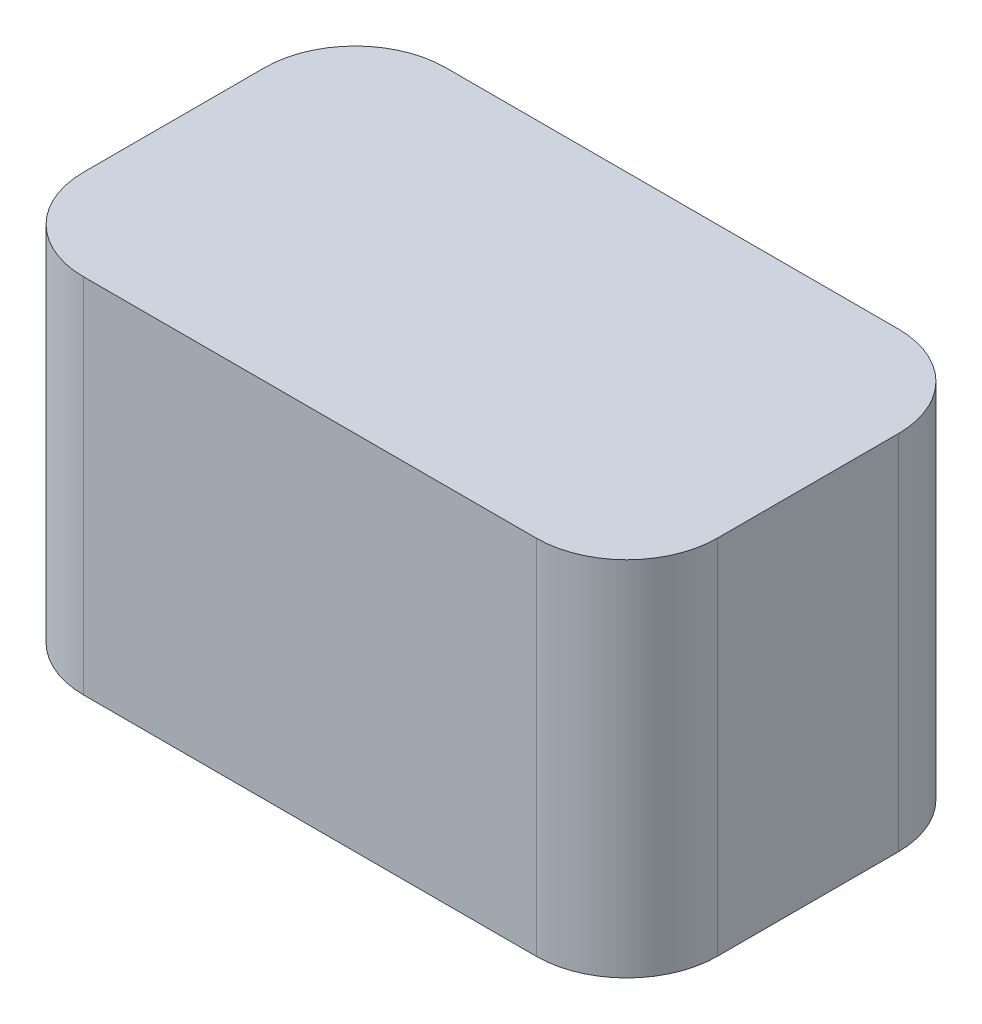
ISO-10303-21;
HEADER;
FILE_DESCRIPTION(('STEP AP214'),'2;1');
FILE_NAME('part.step','',(''),(''),'','','');
FILE_SCHEMA(('AUTOMOTIVE_DESIGN { 1 0 10303 214 1 1 1 1 }'));
ENDSEC;
DATA;
#1=APPLICATION_CONTEXT('core data for automotive mechanical design processes');
#2=APPLICATION_PROTOCOL_DEFINITION('international standard','automotive_design',2000,#1);
#3=PRODUCT_CONTEXT('',#1,'mechanical');
#4=PRODUCT('Part','Part','',(#3));
#5=PRODUCT_RELATED_PRODUCT_CATEGORY('part','',(#4));
#6=PRODUCT_DEFINITION_FORMATION('','',#4);
#7=PRODUCT_DEFINITION_CONTEXT('part definition',#1,'design');
#8=PRODUCT_DEFINITION('design','',#6,#7);
#9=PRODUCT_DEFINITION_SHAPE('','',#8);
#10=(LENGTH_UNIT() NAMED_UNIT(*) SI_UNIT(.MILLI.,.METRE.));
#11=(NAMED_UNIT(*) PLANE_ANGLE_UNIT() SI_UNIT($,.RADIAN.));
#12=(NAMED_UNIT(*) SI_UNIT($,.STERADIAN.) SOLID_ANGLE_UNIT());
#13=UNCERTAINTY_MEASURE_WITH_UNIT(LENGTH_MEASURE(1.E-05),#10,'distance_accuracy_value','');
#14=(GEOMETRIC_REPRESENTATION_CONTEXT(3) GLOBAL_UNCERTAINTY_ASSIGNED_CONTEXT((#13)) GLOBAL_UNIT_ASSIGNED_CONTEXT((#10,
#11,#12)) REPRESENTATION_CONTEXT('',''));
#15=CARTESIAN_POINT('',(0.,0.,0.));
#16=DIRECTION('',(0.,0.,1.));
#17=DIRECTION('',(1.,0.,0.));
#18=AXIS2_PLACEMENT_3D('',#15,#16,#17);
#19=CARTESIAN_POINT('',(-22.225,25.4,-12.7));
#20=DIRECTION('',(1.,0.,0.));
#21=DIRECTION('',(0.,0.,-1.));
#22=AXIS2_PLACEMENT_3D('',#19,#20,#21);
#23=PLANE('',#22);
#24=DIRECTION('',(0.,0.,1.));
#25=VECTOR('',#24,1.);
#26=CARTESIAN_POINT('',(-22.225,25.4,-12.7));
#27=LINE('',#26,#25);
#28=CARTESIAN_POINT('',(-22.225,25.4,-6.35));
#29=VERTEX_POINT('',#28);
#30=CARTESIAN_POINT('',(-22.225,25.4,6.35));
#31=VERTEX_POINT('',#30);
#32=EDGE_CURVE('E139',#29,#31,#27,.T.);
#33=ORIENTED_EDGE('',*,*,#32,.F.);
#34=DIRECTION('',(0.,-1.,0.));
#35=VECTOR('',#34,1.);
#36=CARTESIAN_POINT('',(-22.225,25.4,-6.35));
#37=LINE('',#36,#35);
#38=CARTESIAN_POINT('',(-22.225,0.,-6.35));
#39=VERTEX_POINT('',#38);
#40=EDGE_CURVE('E178',#29,#39,#37,.T.);
#41=ORIENTED_EDGE('',*,*,#40,.T.);
#42=DIRECTION('',(0.,0.,1.));
#43=VECTOR('',#42,1.);
#44=CARTESIAN_POINT('',(-22.225,0.,-12.7));
#45=LINE('',#44,#43);
#46=CARTESIAN_POINT('',(-22.225,0.,6.35));
#47=VERTEX_POINT('',#46);
#48=EDGE_CURVE('E192',#39,#47,#45,.T.);
#49=ORIENTED_EDGE('',*,*,#48,.T.);
#50=DIRECTION('',(0.,-1.,0.));
#51=VECTOR('',#50,1.);
#52=CARTESIAN_POINT('',(-22.225,25.4,6.35));
#53=LINE('',#52,#51);
#54=EDGE_CURVE('E175',#47,#31,#53,.F.);
#55=ORIENTED_EDGE('',*,*,#54,.T.);
#56=EDGE_LOOP('',(#33,#41,#49,#55));
#57=FACE_BOUND('',#56,.T.);
#58=ADVANCED_FACE('F43',(#57),#23,.F.);
#59=CARTESIAN_POINT('',(-22.225,25.4,12.7));
#60=DIRECTION('',(0.,0.,-1.));
#61=DIRECTION('',(-1.,0.,0.));
#62=AXIS2_PLACEMENT_3D('',#59,#60,#61);
#63=PLANE('',#62);
#64=DIRECTION('',(1.,0.,0.));
#65=VECTOR('',#64,1.);
#66=CARTESIAN_POINT('',(-22.225,25.4,12.7));
#67=LINE('',#66,#65);
#68=CARTESIAN_POINT('',(-15.875,25.4,12.7));
#69=VERTEX_POINT('',#68);
#70=CARTESIAN_POINT('',(15.875,25.4,12.7));
#71=VERTEX_POINT('',#70);
#72=EDGE_CURVE('E144',#69,#71,#67,.T.);
#73=ORIENTED_EDGE('',*,*,#72,.F.);
#74=DIRECTION('',(0.,-1.,0.));
#75=VECTOR('',#74,1.);
#76=CARTESIAN_POINT('',(-15.875,25.4,12.7));
#77=LINE('',#76,#75);
#78=CARTESIAN_POINT('',(-15.875,0.,12.7));
#79=VERTEX_POINT('',#78);
#80=EDGE_CURVE('E11',#69,#79,#77,.T.);
#81=ORIENTED_EDGE('',*,*,#80,.T.);
#82=DIRECTION('',(1.,0.,0.));
#83=VECTOR('',#82,1.);
#84=CARTESIAN_POINT('',(-22.225,0.,12.7));
#85=LINE('',#84,#83);
#86=CARTESIAN_POINT('',(15.875,0.,12.7));
#87=VERTEX_POINT('',#86);
#88=EDGE_CURVE('E146',#79,#87,#85,.T.);
#89=ORIENTED_EDGE('',*,*,#88,.T.);
#90=DIRECTION('',(0.,-1.,0.));
#91=VECTOR('',#90,1.);
#92=CARTESIAN_POINT('',(15.875,25.4,12.7));
#93=LINE('',#92,#91);
#94=EDGE_CURVE('E52',#87,#71,#93,.F.);
#95=ORIENTED_EDGE('',*,*,#94,.T.);
#96=EDGE_LOOP('',(#73,#81,#89,#95));
#97=FACE_BOUND('',#96,.T.);
#98=ADVANCED_FACE('F197',(#97),#63,.F.);
#99=CARTESIAN_POINT('',(22.225,25.4,-12.7));
#100=DIRECTION('',(-1.,0.,0.));
#101=DIRECTION('',(0.,0.,1.));
#102=AXIS2_PLACEMENT_3D('',#99,#100,#101);
#103=PLANE('',#102);
#104=DIRECTION('',(0.,0.,-1.));
#105=VECTOR('',#104,1.);
#106=CARTESIAN_POINT('',(22.225,0.,-12.7));
#107=LINE('',#106,#105);
#108=CARTESIAN_POINT('',(22.225,0.,6.35));
#109=VERTEX_POINT('',#108);
#110=CARTESIAN_POINT('',(22.225,0.,-6.35));
#111=VERTEX_POINT('',#110);
#112=EDGE_CURVE('E140',#109,#111,#107,.T.);
#113=ORIENTED_EDGE('',*,*,#112,.T.);
#114=DIRECTION('',(0.,-1.,0.));
#115=VECTOR('',#114,1.);
#116=CARTESIAN_POINT('',(22.225,25.4,-6.35));
#117=LINE('',#116,#115);
#118=CARTESIAN_POINT('',(22.225,25.4,-6.35));
#119=VERTEX_POINT('',#118);
#120=EDGE_CURVE('E115',#111,#119,#117,.F.);
#121=ORIENTED_EDGE('',*,*,#120,.T.);
#122=DIRECTION('',(0.,0.,-1.));
#123=VECTOR('',#122,1.);
#124=CARTESIAN_POINT('',(22.225,25.4,-12.7));
#125=LINE('',#124,#123);
#126=CARTESIAN_POINT('',(22.225,25.4,6.35));
#127=VERTEX_POINT('',#126);
#128=EDGE_CURVE('E184',#127,#119,#125,.T.);
#129=ORIENTED_EDGE('',*,*,#128,.F.);
#130=DIRECTION('',(0.,-1.,0.));
#131=VECTOR('',#130,1.);
#132=CARTESIAN_POINT('',(22.225,25.4,6.35));
#133=LINE('',#132,#131);
#134=EDGE_CURVE('E121',#127,#109,#133,.T.);
#135=ORIENTED_EDGE('',*,*,#134,.T.);
#136=EDGE_LOOP('',(#113,#121,#129,#135));
#137=FACE_BOUND('',#136,.T.);
#138=ADVANCED_FACE('F204',(#137),#103,.F.);
#139=CARTESIAN_POINT('',(-22.225,25.4,-12.7));
#140=DIRECTION('',(0.,0.,1.));
#141=DIRECTION('',(1.,0.,0.));
#142=AXIS2_PLACEMENT_3D('',#139,#140,#141);
#143=PLANE('',#142);
#144=DIRECTION('',(-1.,0.,0.));
#145=VECTOR('',#144,1.);
#146=CARTESIAN_POINT('',(-22.225,25.4,-12.7));
#147=LINE('',#146,#145);
#148=CARTESIAN_POINT('',(15.875,25.4,-12.7));
#149=VERTEX_POINT('',#148);
#150=CARTESIAN_POINT('',(-15.875,25.4,-12.7));
#151=VERTEX_POINT('',#150);
#152=EDGE_CURVE('E131',#149,#151,#147,.T.);
#153=ORIENTED_EDGE('',*,*,#152,.F.);
#154=DIRECTION('',(0.,-1.,0.));
#155=VECTOR('',#154,1.);
#156=CARTESIAN_POINT('',(15.875,25.4,-12.7));
#157=LINE('',#156,#155);
#158=CARTESIAN_POINT('',(15.875,0.,-12.7));
#159=VERTEX_POINT('',#158);
#160=EDGE_CURVE('E114',#149,#159,#157,.T.);
#161=ORIENTED_EDGE('',*,*,#160,.T.);
#162=DIRECTION('',(-1.,0.,0.));
#163=VECTOR('',#162,1.);
#164=CARTESIAN_POINT('',(-22.225,0.,-12.7));
#165=LINE('',#164,#163);
#166=CARTESIAN_POINT('',(-15.875,0.,-12.7));
#167=VERTEX_POINT('',#166);
#168=EDGE_CURVE('E128',#159,#167,#165,.T.);
#169=ORIENTED_EDGE('',*,*,#168,.T.);
#170=DIRECTION('',(0.,-1.,0.));
#171=VECTOR('',#170,1.);
#172=CARTESIAN_POINT('',(-15.875,25.4,-12.7));
#173=LINE('',#172,#171);
#174=EDGE_CURVE('E134',#167,#151,#173,.F.);
#175=ORIENTED_EDGE('',*,*,#174,.T.);
#176=EDGE_LOOP('',(#153,#161,#169,#175));
#177=FACE_BOUND('',#176,.T.);
#178=ADVANCED_FACE('F127',(#177),#143,.F.);
#179=CARTESIAN_POINT('',(0.,25.4,0.));
#180=DIRECTION('',(0.,1.,0.));
#181=DIRECTION('',(0.,0.,1.));
#182=AXIS2_PLACEMENT_3D('',#179,#180,#181);
#183=PLANE('',#182);
#184=ORIENTED_EDGE('',*,*,#128,.T.);
#185=CARTESIAN_POINT('',(15.875,25.4,-6.35));
#186=DIRECTION('',(0.,1.,0.));
#187=DIRECTION('',(0.,0.,1.));
#188=AXIS2_PLACEMENT_3D('',#185,#186,#187);
#189=CIRCLE('',#188,6.35);
#190=EDGE_CURVE('E172',#119,#149,#189,.T.);
#191=ORIENTED_EDGE('',*,*,#190,.T.);
#192=ORIENTED_EDGE('',*,*,#152,.T.);
#193=CARTESIAN_POINT('',(-15.875,25.4,-6.35));
#194=DIRECTION('',(0.,1.,0.));
#195=DIRECTION('',(0.,0.,1.));
#196=AXIS2_PLACEMENT_3D('',#193,#194,#195);
#197=CIRCLE('',#196,6.35);
#198=EDGE_CURVE('E169',#151,#29,#197,.T.);
#199=ORIENTED_EDGE('',*,*,#198,.T.);
#200=ORIENTED_EDGE('',*,*,#32,.T.);
#201=CARTESIAN_POINT('',(-15.875,25.4,6.35));
#202=DIRECTION('',(0.,1.,0.));
#203=DIRECTION('',(0.,0.,1.));
#204=AXIS2_PLACEMENT_3D('',#201,#202,#203);
#205=CIRCLE('',#204,6.35);
#206=EDGE_CURVE('E65',#31,#69,#205,.T.);
#207=ORIENTED_EDGE('',*,*,#206,.T.);
#208=ORIENTED_EDGE('',*,*,#72,.T.);
#209=CARTESIAN_POINT('',(15.875,25.4,6.35));
#210=DIRECTION('',(0.,1.,0.));
#211=DIRECTION('',(0.,0.,1.));
#212=AXIS2_PLACEMENT_3D('',#209,#210,#211);
#213=CIRCLE('',#212,6.35);
#214=EDGE_CURVE('E164',#71,#127,#213,.T.);
#215=ORIENTED_EDGE('',*,*,#214,.T.);
#216=EDGE_LOOP('',(#184,#191,#192,#199,#200,#207,#208,#215));
#217=FACE_BOUND('',#216,.T.);
#218=ADVANCED_FACE('F202',(#217),#183,.T.);
#219=CARTESIAN_POINT('',(0.,0.,0.));
#220=DIRECTION('',(0.,1.,0.));
#221=DIRECTION('',(0.,0.,1.));
#222=AXIS2_PLACEMENT_3D('',#219,#220,#221);
#223=PLANE('',#222);
#224=ORIENTED_EDGE('',*,*,#168,.F.);
#225=CARTESIAN_POINT('',(15.875,0.,-6.35));
#226=DIRECTION('',(0.,1.,0.));
#227=DIRECTION('',(0.,0.,1.));
#228=AXIS2_PLACEMENT_3D('',#225,#226,#227);
#229=CIRCLE('',#228,6.35);
#230=EDGE_CURVE('E110',#159,#111,#229,.F.);
#231=ORIENTED_EDGE('',*,*,#230,.T.);
#232=ORIENTED_EDGE('',*,*,#112,.F.);
#233=CARTESIAN_POINT('',(15.875,0.,6.35));
#234=DIRECTION('',(0.,1.,0.));
#235=DIRECTION('',(0.,0.,1.));
#236=AXIS2_PLACEMENT_3D('',#233,#234,#235);
#237=CIRCLE('',#236,6.35);
#238=EDGE_CURVE('E133',#109,#87,#237,.F.);
#239=ORIENTED_EDGE('',*,*,#238,.T.);
#240=ORIENTED_EDGE('',*,*,#88,.F.);
#241=CARTESIAN_POINT('',(-15.875,0.,6.35));
#242=DIRECTION('',(0.,1.,0.));
#243=DIRECTION('',(0.,0.,1.));
#244=AXIS2_PLACEMENT_3D('',#241,#242,#243);
#245=CIRCLE('',#244,6.35);
#246=EDGE_CURVE('E154',#79,#47,#245,.F.);
#247=ORIENTED_EDGE('',*,*,#246,.T.);
#248=ORIENTED_EDGE('',*,*,#48,.F.);
#249=CARTESIAN_POINT('',(-15.875,0.,-6.35));
#250=DIRECTION('',(0.,1.,0.));
#251=DIRECTION('',(0.,0.,1.));
#252=AXIS2_PLACEMENT_3D('',#249,#250,#251);
#253=CIRCLE('',#252,6.35);
#254=EDGE_CURVE('E122',#39,#167,#253,.F.);
#255=ORIENTED_EDGE('',*,*,#254,.T.);
#256=EDGE_LOOP('',(#224,#231,#232,#239,#240,#247,#248,#255));
#257=FACE_BOUND('',#256,.T.);
#258=ADVANCED_FACE('F136',(#257),#223,.F.);
#259=CARTESIAN_POINT('',(15.875,25.4,-6.35));
#260=DIRECTION('',(0.,-1.,0.));
#261=DIRECTION('',(0.,0.,-1.));
#262=AXIS2_PLACEMENT_3D('',#259,#260,#261);
#263=CYLINDRICAL_SURFACE('',#262,6.35);
#264=ORIENTED_EDGE('',*,*,#190,.F.);
#265=ORIENTED_EDGE('',*,*,#120,.F.);
#266=ORIENTED_EDGE('',*,*,#230,.F.);
#267=ORIENTED_EDGE('',*,*,#160,.F.);
#268=EDGE_LOOP('',(#264,#265,#266,#267));
#269=FACE_BOUND('',#268,.T.);
#270=ADVANCED_FACE('F113',(#269),#263,.T.);
#271=CARTESIAN_POINT('',(-15.875,25.4,-6.35));
#272=DIRECTION('',(0.,-1.,0.));
#273=DIRECTION('',(0.,0.,-1.));
#274=AXIS2_PLACEMENT_3D('',#271,#272,#273);
#275=CYLINDRICAL_SURFACE('',#274,6.35);
#276=ORIENTED_EDGE('',*,*,#198,.F.);
#277=ORIENTED_EDGE('',*,*,#174,.F.);
#278=ORIENTED_EDGE('',*,*,#254,.F.);
#279=ORIENTED_EDGE('',*,*,#40,.F.);
#280=EDGE_LOOP('',(#276,#277,#278,#279));
#281=FACE_BOUND('',#280,.T.);
#282=ADVANCED_FACE('F222',(#281),#275,.T.);
#283=CARTESIAN_POINT('',(-15.875,25.4,6.35));
#284=DIRECTION('',(0.,-1.,0.));
#285=DIRECTION('',(0.,0.,-1.));
#286=AXIS2_PLACEMENT_3D('',#283,#284,#285);
#287=CYLINDRICAL_SURFACE('',#286,6.35);
#288=ORIENTED_EDGE('',*,*,#206,.F.);
#289=ORIENTED_EDGE('',*,*,#54,.F.);
#290=ORIENTED_EDGE('',*,*,#246,.F.);
#291=ORIENTED_EDGE('',*,*,#80,.F.);
#292=EDGE_LOOP('',(#288,#289,#290,#291));
#293=FACE_BOUND('',#292,.T.);
#294=ADVANCED_FACE('F224',(#293),#287,.T.);
#295=CARTESIAN_POINT('',(15.875,25.4,6.35));
#296=DIRECTION('',(0.,-1.,0.));
#297=DIRECTION('',(0.,0.,-1.));
#298=AXIS2_PLACEMENT_3D('',#295,#296,#297);
#299=CYLINDRICAL_SURFACE('',#298,6.35);
#300=ORIENTED_EDGE('',*,*,#214,.F.);
#301=ORIENTED_EDGE('',*,*,#94,.F.);
#302=ORIENTED_EDGE('',*,*,#238,.F.);
#303=ORIENTED_EDGE('',*,*,#134,.F.);
#304=EDGE_LOOP('',(#300,#301,#302,#303));
#305=FACE_BOUND('',#304,.T.);
#306=ADVANCED_FACE('F45',(#305),#299,.T.);
#307=CLOSED_SHELL('',(#58,#98,#138,#178,#218,#258,#270,#282,#294,#306));
#308=MANIFOLD_SOLID_BREP('B2',#307);
#309=ADVANCED_BREP_SHAPE_REPRESENTATION('',(#18,#308),#14);
#310=SHAPE_DEFINITION_REPRESENTATION(#9,#309);
ENDSEC;
END-ISO-10303-21;
